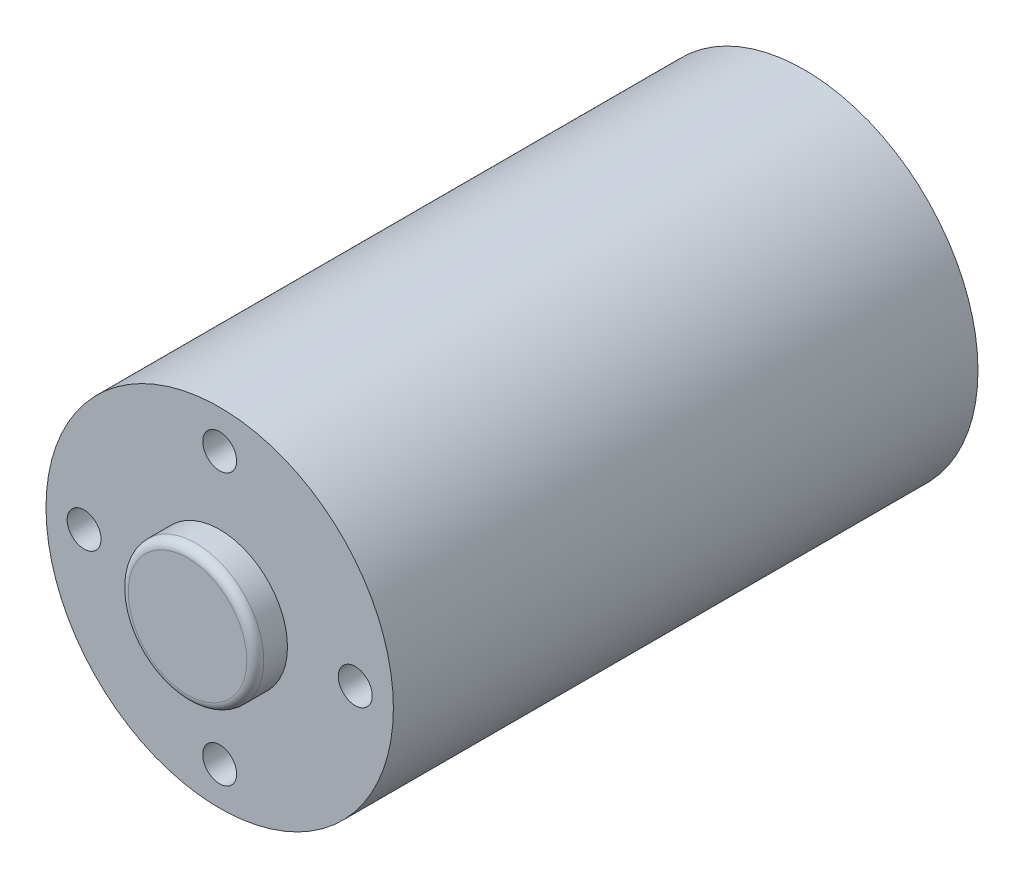
ISO-10303-21;
HEADER;
FILE_DESCRIPTION(('STEP AP214'),'2;1');
FILE_NAME('part.step','',(''),(''),'','','');
FILE_SCHEMA(('AUTOMOTIVE_DESIGN { 1 0 10303 214 1 1 1 1 }'));
ENDSEC;
DATA;
#1=APPLICATION_CONTEXT('core data for automotive mechanical design processes');
#2=APPLICATION_PROTOCOL_DEFINITION('international standard','automotive_design',2000,#1);
#3=PRODUCT_CONTEXT('',#1,'mechanical');
#4=PRODUCT('Part','Part','',(#3));
#5=PRODUCT_RELATED_PRODUCT_CATEGORY('part','',(#4));
#6=PRODUCT_DEFINITION_FORMATION('','',#4);
#7=PRODUCT_DEFINITION_CONTEXT('part definition',#1,'design');
#8=PRODUCT_DEFINITION('design','',#6,#7);
#9=PRODUCT_DEFINITION_SHAPE('','',#8);
#10=(LENGTH_UNIT() NAMED_UNIT(*) SI_UNIT(.MILLI.,.METRE.));
#11=(NAMED_UNIT(*) PLANE_ANGLE_UNIT() SI_UNIT($,.RADIAN.));
#12=(NAMED_UNIT(*) SI_UNIT($,.STERADIAN.) SOLID_ANGLE_UNIT());
#13=UNCERTAINTY_MEASURE_WITH_UNIT(LENGTH_MEASURE(1.E-05),#10,'distance_accuracy_value','');
#14=(GEOMETRIC_REPRESENTATION_CONTEXT(3) GLOBAL_UNCERTAINTY_ASSIGNED_CONTEXT((#13)) GLOBAL_UNIT_ASSIGNED_CONTEXT((#10,
#11,#12)) REPRESENTATION_CONTEXT('',''));
#15=CARTESIAN_POINT('',(0.,0.,0.));
#16=DIRECTION('',(0.,0.,1.));
#17=DIRECTION('',(1.,0.,0.));
#18=AXIS2_PLACEMENT_3D('',#15,#16,#17);
#19=CARTESIAN_POINT('',(0.,0.,-19.));
#20=DIRECTION('',(0.,0.,1.));
#21=DIRECTION('',(1.,0.,0.));
#22=AXIS2_PLACEMENT_3D('',#19,#20,#21);
#23=CYLINDRICAL_SURFACE('',#22,10.25);
#24=CARTESIAN_POINT('',(0.,0.,19.));
#25=DIRECTION('',(0.,0.,1.));
#26=DIRECTION('',(1.,0.,0.));
#27=AXIS2_PLACEMENT_3D('',#24,#25,#26);
#28=CIRCLE('',#27,10.25);
#29=CARTESIAN_POINT('',(10.25,0.,19.));
#30=VERTEX_POINT('',#29);
#31=EDGE_CURVE('E79',#30,#30,#28,.T.);
#32=ORIENTED_EDGE('',*,*,#31,.F.);
#33=EDGE_LOOP('',(#32));
#34=FACE_BOUND('',#33,.T.);
#35=CARTESIAN_POINT('',(0.,0.,-15.5));
#36=DIRECTION('',(0.,0.,-1.));
#37=DIRECTION('',(-1.,0.,0.));
#38=AXIS2_PLACEMENT_3D('',#35,#36,#37);
#39=CIRCLE('',#38,10.25);
#40=CARTESIAN_POINT('',(-10.25,0.,-15.5));
#41=VERTEX_POINT('',#40);
#42=EDGE_CURVE('E91',#41,#41,#39,.T.);
#43=ORIENTED_EDGE('',*,*,#42,.F.);
#44=EDGE_LOOP('',(#43));
#45=FACE_BOUND('',#44,.T.);
#46=ADVANCED_FACE('F61',(#34,#45),#23,.T.);
#47=CARTESIAN_POINT('',(0.,0.,19.));
#48=DIRECTION('',(0.,0.,1.));
#49=DIRECTION('',(1.,0.,0.));
#50=AXIS2_PLACEMENT_3D('',#47,#48,#49);
#51=PLANE('',#50);
#52=CARTESIAN_POINT('',(-8.,0.,19.));
#53=DIRECTION('',(0.,0.,1.));
#54=DIRECTION('',(1.,0.,0.));
#55=AXIS2_PLACEMENT_3D('',#52,#53,#54);
#56=CIRCLE('',#55,1.);
#57=CARTESIAN_POINT('',(-7.,0.,19.));
#58=VERTEX_POINT('',#57);
#59=EDGE_CURVE('E111',#58,#58,#56,.T.);
#60=ORIENTED_EDGE('',*,*,#59,.F.);
#61=EDGE_LOOP('',(#60));
#62=FACE_BOUND('',#61,.T.);
#63=CARTESIAN_POINT('',(0.,-8.,19.));
#64=DIRECTION('',(0.,0.,1.));
#65=DIRECTION('',(1.,0.,0.));
#66=AXIS2_PLACEMENT_3D('',#63,#64,#65);
#67=CIRCLE('',#66,1.);
#68=CARTESIAN_POINT('',(0.999999999999944,-8.,19.));
#69=VERTEX_POINT('',#68);
#70=EDGE_CURVE('E107',#69,#69,#67,.T.);
#71=ORIENTED_EDGE('',*,*,#70,.F.);
#72=EDGE_LOOP('',(#71));
#73=FACE_BOUND('',#72,.T.);
#74=CARTESIAN_POINT('',(8.,0.,19.));
#75=DIRECTION('',(0.,0.,1.));
#76=DIRECTION('',(1.,0.,0.));
#77=AXIS2_PLACEMENT_3D('',#74,#75,#76);
#78=CIRCLE('',#77,1.);
#79=CARTESIAN_POINT('',(9.,0.,19.));
#80=VERTEX_POINT('',#79);
#81=EDGE_CURVE('E99',#80,#80,#78,.T.);
#82=ORIENTED_EDGE('',*,*,#81,.F.);
#83=EDGE_LOOP('',(#82));
#84=FACE_BOUND('',#83,.T.);
#85=CARTESIAN_POINT('',(0.,8.,19.));
#86=DIRECTION('',(0.,0.,1.));
#87=DIRECTION('',(1.,0.,0.));
#88=AXIS2_PLACEMENT_3D('',#85,#86,#87);
#89=CIRCLE('',#88,1.);
#90=CARTESIAN_POINT('',(1.,8.,19.));
#91=VERTEX_POINT('',#90);
#92=EDGE_CURVE('E90',#91,#91,#89,.T.);
#93=ORIENTED_EDGE('',*,*,#92,.F.);
#94=EDGE_LOOP('',(#93));
#95=FACE_BOUND('',#94,.T.);
#96=CARTESIAN_POINT('',(0.,0.,19.));
#97=DIRECTION('',(0.,0.,1.));
#98=DIRECTION('',(1.,0.,0.));
#99=AXIS2_PLACEMENT_3D('',#96,#97,#98);
#100=CIRCLE('',#99,4.);
#101=CARTESIAN_POINT('',(4.,0.,19.));
#102=VERTEX_POINT('',#101);
#103=EDGE_CURVE('E74',#102,#102,#100,.T.);
#104=ORIENTED_EDGE('',*,*,#103,.F.);
#105=EDGE_LOOP('',(#104));
#106=FACE_BOUND('',#105,.T.);
#107=ORIENTED_EDGE('',*,*,#31,.T.);
#108=EDGE_LOOP('',(#107));
#109=FACE_BOUND('',#108,.T.);
#110=ADVANCED_FACE('F145',(#62,#73,#84,#95,#106,#109),#51,.T.);
#111=CARTESIAN_POINT('',(0.,0.,20.9));
#112=DIRECTION('',(0.,0.,-1.));
#113=DIRECTION('',(-1.,0.,0.));
#114=AXIS2_PLACEMENT_3D('',#111,#112,#113);
#115=CYLINDRICAL_SURFACE('',#114,4.);
#116=CARTESIAN_POINT('',(0.,0.,20.4));
#117=DIRECTION('',(0.,0.,1.));
#118=DIRECTION('',(1.,0.,0.));
#119=AXIS2_PLACEMENT_3D('',#116,#117,#118);
#120=CIRCLE('',#119,4.);
#121=CARTESIAN_POINT('',(4.,0.,20.4));
#122=VERTEX_POINT('',#121);
#123=EDGE_CURVE('E11',#122,#122,#120,.F.);
#124=ORIENTED_EDGE('',*,*,#123,.T.);
#125=EDGE_LOOP('',(#124));
#126=FACE_BOUND('',#125,.T.);
#127=ORIENTED_EDGE('',*,*,#103,.T.);
#128=EDGE_LOOP('',(#127));
#129=FACE_BOUND('',#128,.T.);
#130=ADVANCED_FACE('F151',(#126,#129),#115,.T.);
#131=CARTESIAN_POINT('',(0.,0.,20.9));
#132=DIRECTION('',(0.,0.,1.));
#133=DIRECTION('',(1.,0.,0.));
#134=AXIS2_PLACEMENT_3D('',#131,#132,#133);
#135=PLANE('',#134);
#136=CARTESIAN_POINT('',(0.,0.,20.9));
#137=DIRECTION('',(0.,0.,1.));
#138=DIRECTION('',(1.,0.,0.));
#139=AXIS2_PLACEMENT_3D('',#136,#137,#138);
#140=CIRCLE('',#139,3.5);
#141=CARTESIAN_POINT('',(3.5,0.,20.9));
#142=VERTEX_POINT('',#141);
#143=EDGE_CURVE('E69',#142,#142,#140,.T.);
#144=ORIENTED_EDGE('',*,*,#143,.T.);
#145=EDGE_LOOP('',(#144));
#146=FACE_BOUND('',#145,.T.);
#147=ADVANCED_FACE('F158',(#146),#135,.T.);
#148=CARTESIAN_POINT('',(0.,8.,15.5));
#149=DIRECTION('',(0.,0.,1.));
#150=DIRECTION('',(1.,0.,0.));
#151=AXIS2_PLACEMENT_3D('',#148,#149,#150);
#152=CYLINDRICAL_SURFACE('',#151,1.);
#153=ORIENTED_EDGE('',*,*,#92,.T.);
#154=EDGE_LOOP('',(#153));
#155=FACE_BOUND('',#154,.T.);
#156=CARTESIAN_POINT('',(0.,8.,15.5));
#157=DIRECTION('',(0.,0.,1.));
#158=DIRECTION('',(1.,0.,0.));
#159=AXIS2_PLACEMENT_3D('',#156,#157,#158);
#160=CIRCLE('',#159,1.);
#161=CARTESIAN_POINT('',(1.,8.,15.5));
#162=VERTEX_POINT('',#161);
#163=EDGE_CURVE('E86',#162,#162,#160,.T.);
#164=ORIENTED_EDGE('',*,*,#163,.F.);
#165=EDGE_LOOP('',(#164));
#166=FACE_BOUND('',#165,.T.);
#167=ADVANCED_FACE('F161',(#155,#166),#152,.F.);
#168=CARTESIAN_POINT('',(0.,0.,15.5));
#169=DIRECTION('',(0.,0.,1.));
#170=DIRECTION('',(1.,0.,0.));
#171=AXIS2_PLACEMENT_3D('',#168,#169,#170);
#172=PLANE('',#171);
#173=ORIENTED_EDGE('',*,*,#163,.T.);
#174=EDGE_LOOP('',(#173));
#175=FACE_BOUND('',#174,.T.);
#176=ADVANCED_FACE('F162',(#175),#172,.T.);
#177=CARTESIAN_POINT('',(8.,0.,15.5));
#178=DIRECTION('',(0.,0.,1.));
#179=DIRECTION('',(1.,0.,0.));
#180=AXIS2_PLACEMENT_3D('',#177,#178,#179);
#181=CYLINDRICAL_SURFACE('',#180,1.);
#182=CARTESIAN_POINT('',(8.,0.,15.5));
#183=DIRECTION('',(0.,0.,1.));
#184=DIRECTION('',(1.,0.,0.));
#185=AXIS2_PLACEMENT_3D('',#182,#183,#184);
#186=CIRCLE('',#185,1.);
#187=CARTESIAN_POINT('',(9.,0.,15.5));
#188=VERTEX_POINT('',#187);
#189=EDGE_CURVE('E95',#188,#188,#186,.T.);
#190=ORIENTED_EDGE('',*,*,#189,.F.);
#191=EDGE_LOOP('',(#190));
#192=FACE_BOUND('',#191,.T.);
#193=ORIENTED_EDGE('',*,*,#81,.T.);
#194=EDGE_LOOP('',(#193));
#195=FACE_BOUND('',#194,.T.);
#196=ADVANCED_FACE('F165',(#192,#195),#181,.F.);
#197=CARTESIAN_POINT('',(0.,0.,15.5));
#198=DIRECTION('',(0.,0.,1.));
#199=DIRECTION('',(1.,0.,0.));
#200=AXIS2_PLACEMENT_3D('',#197,#198,#199);
#201=PLANE('',#200);
#202=ORIENTED_EDGE('',*,*,#189,.T.);
#203=EDGE_LOOP('',(#202));
#204=FACE_BOUND('',#203,.T.);
#205=ADVANCED_FACE('F170',(#204),#201,.T.);
#206=CARTESIAN_POINT('',(0.,-8.,15.5));
#207=DIRECTION('',(0.,0.,1.));
#208=DIRECTION('',(1.,0.,0.));
#209=AXIS2_PLACEMENT_3D('',#206,#207,#208);
#210=CYLINDRICAL_SURFACE('',#209,1.);
#211=CARTESIAN_POINT('',(0.,-8.,15.5));
#212=DIRECTION('',(0.,0.,1.));
#213=DIRECTION('',(1.,0.,0.));
#214=AXIS2_PLACEMENT_3D('',#211,#212,#213);
#215=CIRCLE('',#214,1.);
#216=CARTESIAN_POINT('',(0.999999999999944,-8.,15.5));
#217=VERTEX_POINT('',#216);
#218=EDGE_CURVE('E103',#217,#217,#215,.T.);
#219=ORIENTED_EDGE('',*,*,#218,.F.);
#220=EDGE_LOOP('',(#219));
#221=FACE_BOUND('',#220,.T.);
#222=ORIENTED_EDGE('',*,*,#70,.T.);
#223=EDGE_LOOP('',(#222));
#224=FACE_BOUND('',#223,.T.);
#225=ADVANCED_FACE('F173',(#221,#224),#210,.F.);
#226=CARTESIAN_POINT('',(0.,0.,15.5));
#227=DIRECTION('',(0.,0.,1.));
#228=DIRECTION('',(1.,0.,0.));
#229=AXIS2_PLACEMENT_3D('',#226,#227,#228);
#230=PLANE('',#229);
#231=ORIENTED_EDGE('',*,*,#218,.T.);
#232=EDGE_LOOP('',(#231));
#233=FACE_BOUND('',#232,.T.);
#234=ADVANCED_FACE('F178',(#233),#230,.T.);
#235=CARTESIAN_POINT('',(-8.,0.,15.5));
#236=DIRECTION('',(0.,0.,1.));
#237=DIRECTION('',(1.,0.,0.));
#238=AXIS2_PLACEMENT_3D('',#235,#236,#237);
#239=CYLINDRICAL_SURFACE('',#238,1.);
#240=CARTESIAN_POINT('',(-8.,0.,15.5));
#241=DIRECTION('',(0.,0.,1.));
#242=DIRECTION('',(1.,0.,0.));
#243=AXIS2_PLACEMENT_3D('',#240,#241,#242);
#244=CIRCLE('',#243,1.);
#245=CARTESIAN_POINT('',(-7.,0.,15.5));
#246=VERTEX_POINT('',#245);
#247=EDGE_CURVE('E84',#246,#246,#244,.T.);
#248=ORIENTED_EDGE('',*,*,#247,.F.);
#249=EDGE_LOOP('',(#248));
#250=FACE_BOUND('',#249,.T.);
#251=ORIENTED_EDGE('',*,*,#59,.T.);
#252=EDGE_LOOP('',(#251));
#253=FACE_BOUND('',#252,.T.);
#254=ADVANCED_FACE('F181',(#250,#253),#239,.F.);
#255=CARTESIAN_POINT('',(0.,0.,15.5));
#256=DIRECTION('',(0.,0.,1.));
#257=DIRECTION('',(1.,0.,0.));
#258=AXIS2_PLACEMENT_3D('',#255,#256,#257);
#259=PLANE('',#258);
#260=ORIENTED_EDGE('',*,*,#247,.T.);
#261=EDGE_LOOP('',(#260));
#262=FACE_BOUND('',#261,.T.);
#263=ADVANCED_FACE('F188',(#262),#259,.T.);
#264=CARTESIAN_POINT('',(0.,0.,20.4));
#265=DIRECTION('',(0.,0.,1.));
#266=DIRECTION('',(1.,0.,0.));
#267=AXIS2_PLACEMENT_3D('',#264,#265,#266);
#268=TOROIDAL_SURFACE('',#267,3.5,0.5);
#269=ORIENTED_EDGE('',*,*,#123,.F.);
#270=EDGE_LOOP('',(#269));
#271=FACE_BOUND('',#270,.T.);
#272=ORIENTED_EDGE('',*,*,#143,.F.);
#273=EDGE_LOOP('',(#272));
#274=FACE_BOUND('',#273,.T.);
#275=ADVANCED_FACE('F63',(#271,#274),#268,.T.);
#276=CARTESIAN_POINT('',(0.,0.,-15.5));
#277=DIRECTION('',(0.,0.,-1.));
#278=DIRECTION('',(1.,0.,0.));
#279=AXIS2_PLACEMENT_3D('',#276,#277,#278);
#280=PLANE('',#279);
#281=CARTESIAN_POINT('',(0.,0.,-15.5));
#282=DIRECTION('',(0.,0.,-1.));
#283=DIRECTION('',(-1.,0.,0.));
#284=AXIS2_PLACEMENT_3D('',#281,#282,#283);
#285=CIRCLE('',#284,1.5);
#286=CARTESIAN_POINT('',(-1.5,0.,-15.5));
#287=VERTEX_POINT('',#286);
#288=EDGE_CURVE('E122',#287,#287,#285,.T.);
#289=ORIENTED_EDGE('',*,*,#288,.F.);
#290=EDGE_LOOP('',(#289));
#291=FACE_BOUND('',#290,.T.);
#292=ORIENTED_EDGE('',*,*,#42,.T.);
#293=EDGE_LOOP('',(#292));
#294=FACE_BOUND('',#293,.T.);
#295=ADVANCED_FACE('F135',(#291,#294),#280,.T.);
#296=CARTESIAN_POINT('',(0.,0.,-10.5));
#297=DIRECTION('',(0.,0.,-1.));
#298=DIRECTION('',(-1.,0.,0.));
#299=AXIS2_PLACEMENT_3D('',#296,#297,#298);
#300=CYLINDRICAL_SURFACE('',#299,1.5);
#301=CARTESIAN_POINT('',(0.,0.,-10.5));
#302=DIRECTION('',(0.,0.,-1.));
#303=DIRECTION('',(-1.,0.,0.));
#304=AXIS2_PLACEMENT_3D('',#301,#302,#303);
#305=CIRCLE('',#304,1.5);
#306=CARTESIAN_POINT('',(-1.5,0.,-10.5));
#307=VERTEX_POINT('',#306);
#308=EDGE_CURVE('E121',#307,#307,#305,.T.);
#309=ORIENTED_EDGE('',*,*,#308,.F.);
#310=EDGE_LOOP('',(#309));
#311=FACE_BOUND('',#310,.T.);
#312=ORIENTED_EDGE('',*,*,#288,.T.);
#313=EDGE_LOOP('',(#312));
#314=FACE_BOUND('',#313,.T.);
#315=ADVANCED_FACE('F132',(#311,#314),#300,.F.);
#316=CARTESIAN_POINT('',(0.,0.,-10.5));
#317=DIRECTION('',(0.,0.,-1.));
#318=DIRECTION('',(-1.,0.,0.));
#319=AXIS2_PLACEMENT_3D('',#316,#317,#318);
#320=PLANE('',#319);
#321=ORIENTED_EDGE('',*,*,#308,.T.);
#322=EDGE_LOOP('',(#321));
#323=FACE_BOUND('',#322,.T.);
#324=ADVANCED_FACE('F130',(#323),#320,.T.);
#325=CLOSED_SHELL('',(#46,#110,#130,#147,#167,#176,#196,#205,#225,#234,#254,#263,#275,#295,#315,#324));
#326=MANIFOLD_SOLID_BREP('B2',#325);
#327=ADVANCED_BREP_SHAPE_REPRESENTATION('',(#18,#326),#14);
#328=SHAPE_DEFINITION_REPRESENTATION(#9,#327);
ENDSEC;
END-ISO-10303-21;
